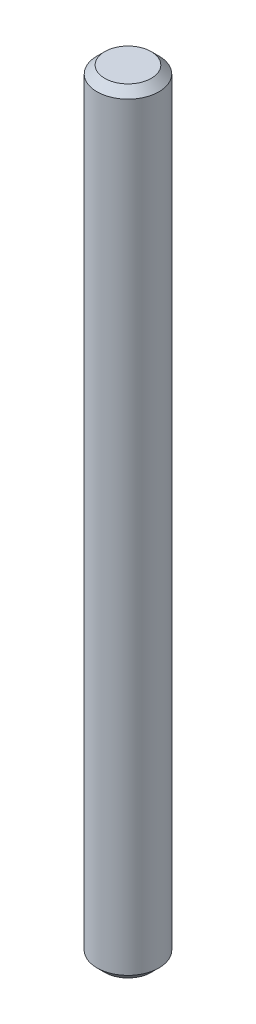
ISO-10303-21;
HEADER;
FILE_DESCRIPTION(('STEP AP214'),'2;1');
FILE_NAME('part.step','',(''),(''),'','','');
FILE_SCHEMA(('AUTOMOTIVE_DESIGN { 1 0 10303 214 1 1 1 1 }'));
ENDSEC;
DATA;
#1=APPLICATION_CONTEXT('core data for automotive mechanical design processes');
#2=APPLICATION_PROTOCOL_DEFINITION('international standard','automotive_design',2000,#1);
#3=PRODUCT_CONTEXT('',#1,'mechanical');
#4=PRODUCT('Part','Part','',(#3));
#5=PRODUCT_RELATED_PRODUCT_CATEGORY('part','',(#4));
#6=PRODUCT_DEFINITION_FORMATION('','',#4);
#7=PRODUCT_DEFINITION_CONTEXT('part definition',#1,'design');
#8=PRODUCT_DEFINITION('design','',#6,#7);
#9=PRODUCT_DEFINITION_SHAPE('','',#8);
#10=(LENGTH_UNIT() NAMED_UNIT(*) SI_UNIT(.MILLI.,.METRE.));
#11=(NAMED_UNIT(*) PLANE_ANGLE_UNIT() SI_UNIT($,.RADIAN.));
#12=(NAMED_UNIT(*) SI_UNIT($,.STERADIAN.) SOLID_ANGLE_UNIT());
#13=UNCERTAINTY_MEASURE_WITH_UNIT(LENGTH_MEASURE(1.E-05),#10,'distance_accuracy_value','');
#14=(GEOMETRIC_REPRESENTATION_CONTEXT(3) GLOBAL_UNCERTAINTY_ASSIGNED_CONTEXT((#13)) GLOBAL_UNIT_ASSIGNED_CONTEXT((#10,
#11,#12)) REPRESENTATION_CONTEXT('',''));
#15=CARTESIAN_POINT('',(0.,0.,0.));
#16=DIRECTION('',(0.,0.,1.));
#17=DIRECTION('',(1.,0.,0.));
#18=AXIS2_PLACEMENT_3D('',#15,#16,#17);
#19=CARTESIAN_POINT('',(0.,100.,0.));
#20=DIRECTION('',(0.,-1.,0.));
#21=DIRECTION('',(0.,0.,-1.));
#22=AXIS2_PLACEMENT_3D('',#19,#20,#21);
#23=CYLINDRICAL_SURFACE('',#22,4.);
#24=CARTESIAN_POINT('',(0.,0.999999999999973,0.));
#25=DIRECTION('',(0.,1.,0.));
#26=DIRECTION('',(0.,0.,1.));
#27=AXIS2_PLACEMENT_3D('',#24,#25,#26);
#28=CIRCLE('',#27,4.);
#29=CARTESIAN_POINT('',(0.,0.999999999999973,4.));
#30=VERTEX_POINT('',#29);
#31=EDGE_CURVE('E45',#30,#30,#28,.T.);
#32=ORIENTED_EDGE('',*,*,#31,.T.);
#33=EDGE_LOOP('',(#32));
#34=FACE_BOUND('',#33,.T.);
#35=CARTESIAN_POINT('',(0.,99.,0.));
#36=DIRECTION('',(0.,1.,0.));
#37=DIRECTION('',(0.,0.,1.));
#38=AXIS2_PLACEMENT_3D('',#35,#36,#37);
#39=CIRCLE('',#38,4.);
#40=CARTESIAN_POINT('',(0.,99.,4.));
#41=VERTEX_POINT('',#40);
#42=EDGE_CURVE('E49',#41,#41,#39,.F.);
#43=ORIENTED_EDGE('',*,*,#42,.T.);
#44=EDGE_LOOP('',(#43));
#45=FACE_BOUND('',#44,.T.);
#46=ADVANCED_FACE('F33',(#34,#45),#23,.T.);
#47=CARTESIAN_POINT('',(0.,100.,0.));
#48=DIRECTION('',(0.,1.,0.));
#49=DIRECTION('',(0.,0.,1.));
#50=AXIS2_PLACEMENT_3D('',#47,#48,#49);
#51=PLANE('',#50);
#52=CARTESIAN_POINT('',(0.,100.,0.));
#53=DIRECTION('',(0.,1.,0.));
#54=DIRECTION('',(0.,0.,1.));
#55=AXIS2_PLACEMENT_3D('',#52,#53,#54);
#56=CIRCLE('',#55,2.99999999999999);
#57=CARTESIAN_POINT('',(0.,100.,2.99999999999999));
#58=VERTEX_POINT('',#57);
#59=EDGE_CURVE('E10',#58,#58,#56,.T.);
#60=ORIENTED_EDGE('',*,*,#59,.T.);
#61=EDGE_LOOP('',(#60));
#62=FACE_BOUND('',#61,.T.);
#63=ADVANCED_FACE('F65',(#62),#51,.T.);
#64=CARTESIAN_POINT('',(0.,0.,0.));
#65=DIRECTION('',(0.,1.,0.));
#66=DIRECTION('',(0.,0.,1.));
#67=AXIS2_PLACEMENT_3D('',#64,#65,#66);
#68=PLANE('',#67);
#69=CARTESIAN_POINT('',(0.,0.,0.));
#70=DIRECTION('',(0.,1.,0.));
#71=DIRECTION('',(0.,0.,1.));
#72=AXIS2_PLACEMENT_3D('',#69,#70,#71);
#73=CIRCLE('',#72,3.00000000000002);
#74=CARTESIAN_POINT('',(0.,0.,3.00000000000002));
#75=VERTEX_POINT('',#74);
#76=EDGE_CURVE('E41',#75,#75,#73,.F.);
#77=ORIENTED_EDGE('',*,*,#76,.T.);
#78=EDGE_LOOP('',(#77));
#79=FACE_BOUND('',#78,.T.);
#80=ADVANCED_FACE('F62',(#79),#68,.F.);
#81=CARTESIAN_POINT('',(0.,0.999999999999973,0.));
#82=DIRECTION('',(0.,1.,0.));
#83=DIRECTION('',(0.,0.,1.));
#84=AXIS2_PLACEMENT_3D('',#81,#82,#83);
#85=CONICAL_SURFACE('',#84,4.,0.785398163397452);
#86=ORIENTED_EDGE('',*,*,#76,.F.);
#87=EDGE_LOOP('',(#86));
#88=FACE_BOUND('',#87,.T.);
#89=ORIENTED_EDGE('',*,*,#31,.F.);
#90=EDGE_LOOP('',(#89));
#91=FACE_BOUND('',#90,.T.);
#92=ADVANCED_FACE('F58',(#88,#91),#85,.T.);
#93=CARTESIAN_POINT('',(0.,100.,0.));
#94=DIRECTION('',(0.,-1.,0.));
#95=DIRECTION('',(0.,0.,-1.));
#96=AXIS2_PLACEMENT_3D('',#93,#94,#95);
#97=CONICAL_SURFACE('',#96,2.99999999999999,0.785398163397452);
#98=ORIENTED_EDGE('',*,*,#42,.F.);
#99=EDGE_LOOP('',(#98));
#100=FACE_BOUND('',#99,.T.);
#101=ORIENTED_EDGE('',*,*,#59,.F.);
#102=EDGE_LOOP('',(#101));
#103=FACE_BOUND('',#102,.T.);
#104=ADVANCED_FACE('F36',(#100,#103),#97,.T.);
#105=CLOSED_SHELL('',(#46,#63,#80,#92,#104));
#106=MANIFOLD_SOLID_BREP('B2',#105);
#107=ADVANCED_BREP_SHAPE_REPRESENTATION('',(#18,#106),#14);
#108=SHAPE_DEFINITION_REPRESENTATION(#9,#107);
ENDSEC;
END-ISO-10303-21;
